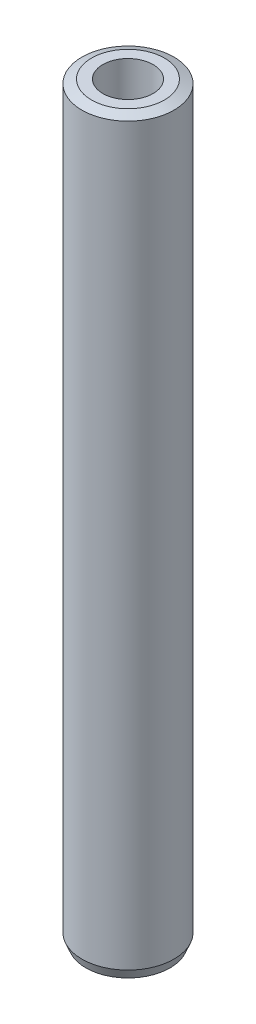
ISO-10303-21;
HEADER;
FILE_DESCRIPTION(('STEP AP214'),'2;1');
FILE_NAME('part.step','',(''),(''),'','','');
FILE_SCHEMA(('AUTOMOTIVE_DESIGN { 1 0 10303 214 1 1 1 1 }'));
ENDSEC;
DATA;
#1=APPLICATION_CONTEXT('core data for automotive mechanical design processes');
#2=APPLICATION_PROTOCOL_DEFINITION('international standard','automotive_design',2000,#1);
#3=PRODUCT_CONTEXT('',#1,'mechanical');
#4=PRODUCT('Part','Part','',(#3));
#5=PRODUCT_RELATED_PRODUCT_CATEGORY('part','',(#4));
#6=PRODUCT_DEFINITION_FORMATION('','',#4);
#7=PRODUCT_DEFINITION_CONTEXT('part definition',#1,'design');
#8=PRODUCT_DEFINITION('design','',#6,#7);
#9=PRODUCT_DEFINITION_SHAPE('','',#8);
#10=(LENGTH_UNIT() NAMED_UNIT(*) SI_UNIT(.MILLI.,.METRE.));
#11=(NAMED_UNIT(*) PLANE_ANGLE_UNIT() SI_UNIT($,.RADIAN.));
#12=(NAMED_UNIT(*) SI_UNIT($,.STERADIAN.) SOLID_ANGLE_UNIT());
#13=UNCERTAINTY_MEASURE_WITH_UNIT(LENGTH_MEASURE(1.E-05),#10,'distance_accuracy_value','');
#14=(GEOMETRIC_REPRESENTATION_CONTEXT(3) GLOBAL_UNCERTAINTY_ASSIGNED_CONTEXT((#13)) GLOBAL_UNIT_ASSIGNED_CONTEXT((#10,
#11,#12)) REPRESENTATION_CONTEXT('',''));
#15=CARTESIAN_POINT('',(0.,0.,0.));
#16=DIRECTION('',(0.,0.,1.));
#17=DIRECTION('',(1.,0.,0.));
#18=AXIS2_PLACEMENT_3D('',#15,#16,#17);
#19=CARTESIAN_POINT('',(0.,203.289773445694,0.));
#20=DIRECTION('',(0.,-1.,0.));
#21=DIRECTION('',(0.,0.,-1.));
#22=AXIS2_PLACEMENT_3D('',#19,#20,#21);
#23=CYLINDRICAL_SURFACE('',#22,12.5);
#24=CARTESIAN_POINT('',(0.,202.217335082978,0.));
#25=DIRECTION('',(0.,1.,0.));
#26=DIRECTION('',(0.,0.,1.));
#27=AXIS2_PLACEMENT_3D('',#24,#25,#26);
#28=CIRCLE('',#27,12.5);
#29=CARTESIAN_POINT('',(0.,202.217335082978,12.5));
#30=VERTEX_POINT('',#29);
#31=EDGE_CURVE('E50',#30,#30,#28,.F.);
#32=ORIENTED_EDGE('',*,*,#31,.T.);
#33=EDGE_LOOP('',(#32));
#34=FACE_BOUND('',#33,.T.);
#35=CARTESIAN_POINT('',(0.,2.61332925022395,0.));
#36=DIRECTION('',(0.,1.,0.));
#37=DIRECTION('',(0.,0.,1.));
#38=AXIS2_PLACEMENT_3D('',#35,#36,#37);
#39=CIRCLE('',#38,12.5);
#40=CARTESIAN_POINT('',(0.,2.61332925022395,12.5));
#41=VERTEX_POINT('',#40);
#42=EDGE_CURVE('E51',#41,#41,#39,.T.);
#43=ORIENTED_EDGE('',*,*,#42,.T.);
#44=EDGE_LOOP('',(#43));
#45=FACE_BOUND('',#44,.T.);
#46=ADVANCED_FACE('F39',(#34,#45),#23,.T.);
#47=CARTESIAN_POINT('',(0.,203.289773445694,0.));
#48=DIRECTION('',(0.,1.,0.));
#49=DIRECTION('',(0.,0.,1.));
#50=AXIS2_PLACEMENT_3D('',#47,#48,#49);
#51=PLANE('',#50);
#52=CARTESIAN_POINT('',(0.,203.289773445694,0.));
#53=DIRECTION('',(0.,1.,0.));
#54=DIRECTION('',(0.,0.,1.));
#55=AXIS2_PLACEMENT_3D('',#52,#53,#54);
#56=CIRCLE('',#55,9.88667074977612);
#57=CARTESIAN_POINT('',(0.,203.289773445694,9.88667074977612));
#58=VERTEX_POINT('',#57);
#59=EDGE_CURVE('E54',#58,#58,#56,.T.);
#60=ORIENTED_EDGE('',*,*,#59,.T.);
#61=EDGE_LOOP('',(#60));
#62=FACE_BOUND('',#61,.T.);
#63=CARTESIAN_POINT('',(0.,203.289773445694,0.));
#64=DIRECTION('',(0.,1.,0.));
#65=DIRECTION('',(0.,0.,1.));
#66=AXIS2_PLACEMENT_3D('',#63,#64,#65);
#67=CIRCLE('',#66,6.82698400912334);
#68=CARTESIAN_POINT('',(0.,203.289773445694,6.82698400912334));
#69=VERTEX_POINT('',#68);
#70=EDGE_CURVE('E58',#69,#69,#67,.T.);
#71=ORIENTED_EDGE('',*,*,#70,.F.);
#72=EDGE_LOOP('',(#71));
#73=FACE_BOUND('',#72,.T.);
#74=ADVANCED_FACE('F69',(#62,#73),#51,.T.);
#75=CARTESIAN_POINT('',(0.,0.,0.));
#76=DIRECTION('',(0.,1.,0.));
#77=DIRECTION('',(0.,0.,1.));
#78=AXIS2_PLACEMENT_3D('',#75,#76,#77);
#79=PLANE('',#78);
#80=CARTESIAN_POINT('',(0.,0.,0.));
#81=DIRECTION('',(0.,1.,0.));
#82=DIRECTION('',(0.,0.,1.));
#83=AXIS2_PLACEMENT_3D('',#80,#81,#82);
#84=CIRCLE('',#83,11.4275616372836);
#85=CARTESIAN_POINT('',(0.,0.,11.4275616372836));
#86=VERTEX_POINT('',#85);
#87=EDGE_CURVE('E10',#86,#86,#84,.F.);
#88=ORIENTED_EDGE('',*,*,#87,.T.);
#89=EDGE_LOOP('',(#88));
#90=FACE_BOUND('',#89,.T.);
#91=CARTESIAN_POINT('',(0.,0.,0.));
#92=DIRECTION('',(0.,1.,0.));
#93=DIRECTION('',(0.,0.,1.));
#94=AXIS2_PLACEMENT_3D('',#91,#92,#93);
#95=CIRCLE('',#94,6.82698400912334);
#96=CARTESIAN_POINT('',(0.,0.,6.82698400912334));
#97=VERTEX_POINT('',#96);
#98=EDGE_CURVE('E63',#97,#97,#95,.T.);
#99=ORIENTED_EDGE('',*,*,#98,.T.);
#100=EDGE_LOOP('',(#99));
#101=FACE_BOUND('',#100,.T.);
#102=ADVANCED_FACE('F75',(#90,#101),#79,.F.);
#103=CARTESIAN_POINT('',(0.,203.289773445694,0.));
#104=DIRECTION('',(0.,-1.,0.));
#105=DIRECTION('',(0.,0.,-1.));
#106=AXIS2_PLACEMENT_3D('',#103,#104,#105);
#107=CYLINDRICAL_SURFACE('',#106,6.82698400912334);
#108=ORIENTED_EDGE('',*,*,#70,.T.);
#109=EDGE_LOOP('',(#108));
#110=FACE_BOUND('',#109,.T.);
#111=ORIENTED_EDGE('',*,*,#98,.F.);
#112=EDGE_LOOP('',(#111));
#113=FACE_BOUND('',#112,.T.);
#114=ADVANCED_FACE('F70',(#110,#113),#107,.F.);
#115=CARTESIAN_POINT('',(0.,203.289773445694,0.));
#116=DIRECTION('',(0.,-1.,0.));
#117=DIRECTION('',(0.,0.,-1.));
#118=AXIS2_PLACEMENT_3D('',#115,#116,#117);
#119=CONICAL_SURFACE('',#118,9.88667074977612,1.18138027462841);
#120=ORIENTED_EDGE('',*,*,#31,.F.);
#121=EDGE_LOOP('',(#120));
#122=FACE_BOUND('',#121,.T.);
#123=ORIENTED_EDGE('',*,*,#59,.F.);
#124=EDGE_LOOP('',(#123));
#125=FACE_BOUND('',#124,.T.);
#126=ADVANCED_FACE('F81',(#122,#125),#119,.T.);
#127=CARTESIAN_POINT('',(0.,2.61332925022395,0.));
#128=DIRECTION('',(0.,1.,0.));
#129=DIRECTION('',(0.,0.,1.));
#130=AXIS2_PLACEMENT_3D('',#127,#128,#129);
#131=CONICAL_SURFACE('',#130,12.5,0.389416052166485);
#132=ORIENTED_EDGE('',*,*,#87,.F.);
#133=EDGE_LOOP('',(#132));
#134=FACE_BOUND('',#133,.T.);
#135=ORIENTED_EDGE('',*,*,#42,.F.);
#136=EDGE_LOOP('',(#135));
#137=FACE_BOUND('',#136,.T.);
#138=ADVANCED_FACE('F45',(#134,#137),#131,.T.);
#139=CLOSED_SHELL('',(#46,#74,#102,#114,#126,#138));
#140=MANIFOLD_SOLID_BREP('B2',#139);
#141=ADVANCED_BREP_SHAPE_REPRESENTATION('',(#18,#140),#14);
#142=SHAPE_DEFINITION_REPRESENTATION(#9,#141);
ENDSEC;
END-ISO-10303-21;
